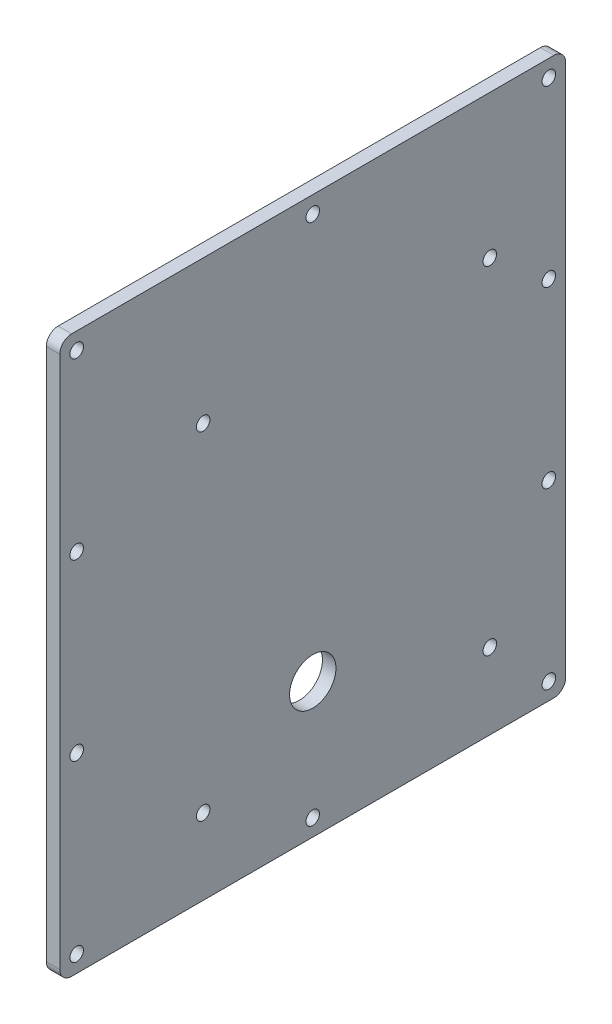
ISO-10303-21;
HEADER;
FILE_DESCRIPTION(('STEP AP214'),'2;1');
FILE_NAME('part.step','',(''),(''),'','','');
FILE_SCHEMA(('AUTOMOTIVE_DESIGN { 1 0 10303 214 1 1 1 1 }'));
ENDSEC;
DATA;
#1=APPLICATION_CONTEXT('core data for automotive mechanical design processes');
#2=APPLICATION_PROTOCOL_DEFINITION('international standard','automotive_design',2000,#1);
#3=PRODUCT_CONTEXT('',#1,'mechanical');
#4=PRODUCT('Part','Part','',(#3));
#5=PRODUCT_RELATED_PRODUCT_CATEGORY('part','',(#4));
#6=PRODUCT_DEFINITION_FORMATION('','',#4);
#7=PRODUCT_DEFINITION_CONTEXT('part definition',#1,'design');
#8=PRODUCT_DEFINITION('design','',#6,#7);
#9=PRODUCT_DEFINITION_SHAPE('','',#8);
#10=(LENGTH_UNIT() NAMED_UNIT(*) SI_UNIT(.MILLI.,.METRE.));
#11=(NAMED_UNIT(*) PLANE_ANGLE_UNIT() SI_UNIT($,.RADIAN.));
#12=(NAMED_UNIT(*) SI_UNIT($,.STERADIAN.) SOLID_ANGLE_UNIT());
#13=UNCERTAINTY_MEASURE_WITH_UNIT(LENGTH_MEASURE(1.E-05),#10,'distance_accuracy_value','');
#14=(GEOMETRIC_REPRESENTATION_CONTEXT(3) GLOBAL_UNCERTAINTY_ASSIGNED_CONTEXT((#13)) GLOBAL_UNIT_ASSIGNED_CONTEXT((#10,
#11,#12)) REPRESENTATION_CONTEXT('',''));
#15=CARTESIAN_POINT('',(0.,0.,0.));
#16=DIRECTION('',(0.,0.,1.));
#17=DIRECTION('',(1.,0.,0.));
#18=AXIS2_PLACEMENT_3D('',#15,#16,#17);
#19=CARTESIAN_POINT('',(0.,0.,0.));
#20=DIRECTION('',(-1.,0.,0.));
#21=DIRECTION('',(0.,0.,1.));
#22=AXIS2_PLACEMENT_3D('',#19,#20,#21);
#23=PLANE('',#22);
#24=DIRECTION('',(0.,0.,-1.));
#25=VECTOR('',#24,1.);
#26=CARTESIAN_POINT('',(0.,0.,0.));
#27=LINE('',#26,#25);
#28=CARTESIAN_POINT('',(0.,0.,-4.445));
#29=VERTEX_POINT('',#28);
#30=CARTESIAN_POINT('',(0.,0.,-186.055));
#31=VERTEX_POINT('',#30);
#32=EDGE_CURVE('E133',#29,#31,#27,.T.);
#33=ORIENTED_EDGE('',*,*,#32,.F.);
#34=CARTESIAN_POINT('',(0.,4.445,-4.445));
#35=DIRECTION('',(-1.,0.,0.));
#36=DIRECTION('',(0.,0.,1.));
#37=AXIS2_PLACEMENT_3D('',#34,#35,#36);
#38=CIRCLE('',#37,4.445);
#39=CARTESIAN_POINT('',(0.,4.445,0.));
#40=VERTEX_POINT('',#39);
#41=EDGE_CURVE('E116',#29,#40,#38,.T.);
#42=ORIENTED_EDGE('',*,*,#41,.T.);
#43=DIRECTION('',(0.,-1.,0.));
#44=VECTOR('',#43,1.);
#45=CARTESIAN_POINT('',(0.,0.,0.));
#46=LINE('',#45,#44);
#47=CARTESIAN_POINT('',(0.,205.105,0.));
#48=VERTEX_POINT('',#47);
#49=EDGE_CURVE('E143',#48,#40,#46,.T.);
#50=ORIENTED_EDGE('',*,*,#49,.F.);
#51=CARTESIAN_POINT('',(0.,205.105,-4.445));
#52=DIRECTION('',(-1.,0.,0.));
#53=DIRECTION('',(0.,0.,1.));
#54=AXIS2_PLACEMENT_3D('',#51,#52,#53);
#55=CIRCLE('',#54,4.445);
#56=CARTESIAN_POINT('',(0.,209.55,-4.445));
#57=VERTEX_POINT('',#56);
#58=EDGE_CURVE('E137',#48,#57,#55,.T.);
#59=ORIENTED_EDGE('',*,*,#58,.T.);
#60=DIRECTION('',(0.,0.,1.));
#61=VECTOR('',#60,1.);
#62=CARTESIAN_POINT('',(0.,209.55,0.));
#63=LINE('',#62,#61);
#64=CARTESIAN_POINT('',(0.,209.55,-186.055));
#65=VERTEX_POINT('',#64);
#66=EDGE_CURVE('E146',#65,#57,#63,.T.);
#67=ORIENTED_EDGE('',*,*,#66,.F.);
#68=CARTESIAN_POINT('',(0.,205.105,-186.055));
#69=DIRECTION('',(-1.,0.,0.));
#70=DIRECTION('',(0.,0.,1.));
#71=AXIS2_PLACEMENT_3D('',#68,#69,#70);
#72=CIRCLE('',#71,4.445);
#73=CARTESIAN_POINT('',(0.,205.105,-190.5));
#74=VERTEX_POINT('',#73);
#75=EDGE_CURVE('E157',#65,#74,#72,.T.);
#76=ORIENTED_EDGE('',*,*,#75,.T.);
#77=DIRECTION('',(0.,1.,0.));
#78=VECTOR('',#77,1.);
#79=CARTESIAN_POINT('',(0.,0.,-190.5));
#80=LINE('',#79,#78);
#81=CARTESIAN_POINT('',(0.,4.445,-190.5));
#82=VERTEX_POINT('',#81);
#83=EDGE_CURVE('E142',#82,#74,#80,.T.);
#84=ORIENTED_EDGE('',*,*,#83,.F.);
#85=CARTESIAN_POINT('',(0.,4.445,-186.055));
#86=DIRECTION('',(-1.,0.,0.));
#87=DIRECTION('',(0.,0.,1.));
#88=AXIS2_PLACEMENT_3D('',#85,#86,#87);
#89=CIRCLE('',#88,4.445);
#90=EDGE_CURVE('E127',#82,#31,#89,.T.);
#91=ORIENTED_EDGE('',*,*,#90,.T.);
#92=EDGE_LOOP('',(#33,#42,#50,#59,#67,#76,#84,#91));
#93=FACE_BOUND('',#92,.T.);
#94=CARTESIAN_POINT('',(0.,50.8000000000041,-95.25));
#95=DIRECTION('',(1.,0.,0.));
#96=DIRECTION('',(0.,0.,-1.));
#97=AXIS2_PLACEMENT_3D('',#94,#95,#96);
#98=CIRCLE('',#97,8.73125);
#99=CARTESIAN_POINT('',(0.,50.8000000000041,-103.98125));
#100=VERTEX_POINT('',#99);
#101=EDGE_CURVE('E148',#100,#100,#98,.T.);
#102=ORIENTED_EDGE('',*,*,#101,.T.);
#103=EDGE_LOOP('',(#102));
#104=FACE_BOUND('',#103,.T.);
#105=CARTESIAN_POINT('',(0.,28.5749999999997,-53.9750000000013));
#106=DIRECTION('',(1.,0.,0.));
#107=DIRECTION('',(0.,0.,-1.));
#108=AXIS2_PLACEMENT_3D('',#105,#106,#107);
#109=CIRCLE('',#108,2.5527);
#110=CARTESIAN_POINT('',(0.,28.5749999999997,-56.5277000000013));
#111=VERTEX_POINT('',#110);
#112=EDGE_CURVE('E196',#111,#111,#109,.T.);
#113=ORIENTED_EDGE('',*,*,#112,.T.);
#114=EDGE_LOOP('',(#113));
#115=FACE_BOUND('',#114,.T.);
#116=CARTESIAN_POINT('',(0.,28.5750000000009,-161.925));
#117=DIRECTION('',(1.,0.,0.));
#118=DIRECTION('',(0.,0.,-1.));
#119=AXIS2_PLACEMENT_3D('',#116,#117,#118);
#120=CIRCLE('',#119,2.5527);
#121=CARTESIAN_POINT('',(0.,28.5750000000009,-164.4777));
#122=VERTEX_POINT('',#121);
#123=EDGE_CURVE('E204',#122,#122,#120,.T.);
#124=ORIENTED_EDGE('',*,*,#123,.T.);
#125=EDGE_LOOP('',(#124));
#126=FACE_BOUND('',#125,.T.);
#127=CARTESIAN_POINT('',(0.,155.575000000001,-161.925));
#128=DIRECTION('',(1.,0.,0.));
#129=DIRECTION('',(0.,0.,-1.));
#130=AXIS2_PLACEMENT_3D('',#127,#128,#129);
#131=CIRCLE('',#130,2.55269999999999);
#132=CARTESIAN_POINT('',(0.,155.575000000001,-164.4777));
#133=VERTEX_POINT('',#132);
#134=EDGE_CURVE('E210',#133,#133,#131,.T.);
#135=ORIENTED_EDGE('',*,*,#134,.T.);
#136=EDGE_LOOP('',(#135));
#137=FACE_BOUND('',#136,.T.);
#138=CARTESIAN_POINT('',(0.,155.575000000001,-53.9750000000003));
#139=DIRECTION('',(1.,0.,0.));
#140=DIRECTION('',(0.,0.,-1.));
#141=AXIS2_PLACEMENT_3D('',#138,#139,#140);
#142=CIRCLE('',#141,2.55269999999999);
#143=CARTESIAN_POINT('',(0.,155.575000000001,-56.5277000000003));
#144=VERTEX_POINT('',#143);
#145=EDGE_CURVE('E216',#144,#144,#142,.T.);
#146=ORIENTED_EDGE('',*,*,#145,.T.);
#147=EDGE_LOOP('',(#146));
#148=FACE_BOUND('',#147,.T.);
#149=CARTESIAN_POINT('',(0.,137.583333333333,-184.15));
#150=DIRECTION('',(1.,0.,0.));
#151=DIRECTION('',(0.,0.,-1.));
#152=AXIS2_PLACEMENT_3D('',#149,#150,#151);
#153=CIRCLE('',#152,2.55269999999999);
#154=CARTESIAN_POINT('',(0.,137.583333333333,-186.7027));
#155=VERTEX_POINT('',#154);
#156=EDGE_CURVE('E222',#155,#155,#153,.T.);
#157=ORIENTED_EDGE('',*,*,#156,.T.);
#158=EDGE_LOOP('',(#157));
#159=FACE_BOUND('',#158,.T.);
#160=CARTESIAN_POINT('',(0.,71.9666666666667,-184.15));
#161=DIRECTION('',(1.,0.,0.));
#162=DIRECTION('',(0.,0.,-1.));
#163=AXIS2_PLACEMENT_3D('',#160,#161,#162);
#164=CIRCLE('',#163,2.55270000000001);
#165=CARTESIAN_POINT('',(0.,71.9666666666667,-186.7027));
#166=VERTEX_POINT('',#165);
#167=EDGE_CURVE('E228',#166,#166,#164,.T.);
#168=ORIENTED_EDGE('',*,*,#167,.T.);
#169=EDGE_LOOP('',(#168));
#170=FACE_BOUND('',#169,.T.);
#171=CARTESIAN_POINT('',(0.,71.9666666666667,-6.35000000000002));
#172=DIRECTION('',(1.,0.,0.));
#173=DIRECTION('',(0.,0.,-1.));
#174=AXIS2_PLACEMENT_3D('',#171,#172,#173);
#175=CIRCLE('',#174,2.55270000000001);
#176=CARTESIAN_POINT('',(0.,71.9666666666667,-8.90270000000002));
#177=VERTEX_POINT('',#176);
#178=EDGE_CURVE('E234',#177,#177,#175,.T.);
#179=ORIENTED_EDGE('',*,*,#178,.T.);
#180=EDGE_LOOP('',(#179));
#181=FACE_BOUND('',#180,.T.);
#182=CARTESIAN_POINT('',(0.,137.583333333333,-6.35000000000001));
#183=DIRECTION('',(1.,0.,0.));
#184=DIRECTION('',(0.,0.,-1.));
#185=AXIS2_PLACEMENT_3D('',#182,#183,#184);
#186=CIRCLE('',#185,2.55269999999999);
#187=CARTESIAN_POINT('',(0.,137.583333333333,-8.9027));
#188=VERTEX_POINT('',#187);
#189=EDGE_CURVE('E240',#188,#188,#186,.T.);
#190=ORIENTED_EDGE('',*,*,#189,.T.);
#191=EDGE_LOOP('',(#190));
#192=FACE_BOUND('',#191,.T.);
#193=CARTESIAN_POINT('',(0.,203.2,-95.25));
#194=DIRECTION('',(1.,0.,0.));
#195=DIRECTION('',(0.,0.,-1.));
#196=AXIS2_PLACEMENT_3D('',#193,#194,#195);
#197=CIRCLE('',#196,2.55269999999999);
#198=CARTESIAN_POINT('',(0.,203.2,-97.8027));
#199=VERTEX_POINT('',#198);
#200=EDGE_CURVE('E246',#199,#199,#197,.T.);
#201=ORIENTED_EDGE('',*,*,#200,.T.);
#202=EDGE_LOOP('',(#201));
#203=FACE_BOUND('',#202,.T.);
#204=CARTESIAN_POINT('',(0.,6.35,-95.25));
#205=DIRECTION('',(1.,0.,0.));
#206=DIRECTION('',(0.,0.,-1.));
#207=AXIS2_PLACEMENT_3D('',#204,#205,#206);
#208=CIRCLE('',#207,2.5527);
#209=CARTESIAN_POINT('',(0.,6.35,-97.8027));
#210=VERTEX_POINT('',#209);
#211=EDGE_CURVE('E252',#210,#210,#208,.T.);
#212=ORIENTED_EDGE('',*,*,#211,.T.);
#213=EDGE_LOOP('',(#212));
#214=FACE_BOUND('',#213,.T.);
#215=CARTESIAN_POINT('',(0.,203.2,-184.15));
#216=DIRECTION('',(1.,0.,0.));
#217=DIRECTION('',(0.,0.,-1.));
#218=AXIS2_PLACEMENT_3D('',#215,#216,#217);
#219=CIRCLE('',#218,2.55269999999999);
#220=CARTESIAN_POINT('',(0.,203.2,-186.7027));
#221=VERTEX_POINT('',#220);
#222=EDGE_CURVE('E258',#221,#221,#219,.T.);
#223=ORIENTED_EDGE('',*,*,#222,.T.);
#224=EDGE_LOOP('',(#223));
#225=FACE_BOUND('',#224,.T.);
#226=CARTESIAN_POINT('',(0.,6.35,-6.35000000000003));
#227=DIRECTION('',(1.,0.,0.));
#228=DIRECTION('',(0.,0.,-1.));
#229=AXIS2_PLACEMENT_3D('',#226,#227,#228);
#230=CIRCLE('',#229,2.5527);
#231=CARTESIAN_POINT('',(0.,6.35,-8.90270000000003));
#232=VERTEX_POINT('',#231);
#233=EDGE_CURVE('E264',#232,#232,#230,.T.);
#234=ORIENTED_EDGE('',*,*,#233,.T.);
#235=EDGE_LOOP('',(#234));
#236=FACE_BOUND('',#235,.T.);
#237=CARTESIAN_POINT('',(0.,6.35000000000003,-184.15));
#238=DIRECTION('',(1.,0.,0.));
#239=DIRECTION('',(0.,0.,-1.));
#240=AXIS2_PLACEMENT_3D('',#237,#238,#239);
#241=CIRCLE('',#240,2.5527);
#242=CARTESIAN_POINT('',(0.,6.35000000000003,-186.7027));
#243=VERTEX_POINT('',#242);
#244=EDGE_CURVE('E270',#243,#243,#241,.T.);
#245=ORIENTED_EDGE('',*,*,#244,.T.);
#246=EDGE_LOOP('',(#245));
#247=FACE_BOUND('',#246,.T.);
#248=CARTESIAN_POINT('',(0.,203.2,-6.35));
#249=DIRECTION('',(1.,0.,0.));
#250=DIRECTION('',(0.,0.,-1.));
#251=AXIS2_PLACEMENT_3D('',#248,#249,#250);
#252=CIRCLE('',#251,2.55269999999999);
#253=CARTESIAN_POINT('',(0.,203.2,-8.90269999999999));
#254=VERTEX_POINT('',#253);
#255=EDGE_CURVE('E276',#254,#254,#252,.T.);
#256=ORIENTED_EDGE('',*,*,#255,.T.);
#257=EDGE_LOOP('',(#256));
#258=FACE_BOUND('',#257,.T.);
#259=ADVANCED_FACE('F50',(#93,#104,#115,#126,#137,#148,#159,#170,#181,#192,#203,#214,#225,#236,
#247,#258),#23,.T.);
#260=CARTESIAN_POINT('',(5.08,0.,0.));
#261=DIRECTION('',(0.,0.,-1.));
#262=DIRECTION('',(-1.,0.,0.));
#263=AXIS2_PLACEMENT_3D('',#260,#261,#262);
#264=PLANE('',#263);
#265=ORIENTED_EDGE('',*,*,#49,.T.);
#266=DIRECTION('',(-1.,0.,0.));
#267=VECTOR('',#266,1.);
#268=CARTESIAN_POINT('',(5.08,4.445,0.));
#269=LINE('',#268,#267);
#270=CARTESIAN_POINT('',(5.08,4.445,0.));
#271=VERTEX_POINT('',#270);
#272=EDGE_CURVE('E121',#40,#271,#269,.F.);
#273=ORIENTED_EDGE('',*,*,#272,.T.);
#274=DIRECTION('',(0.,-1.,0.));
#275=VECTOR('',#274,1.);
#276=CARTESIAN_POINT('',(5.08,0.,0.));
#277=LINE('',#276,#275);
#278=CARTESIAN_POINT('',(5.08,205.105,0.));
#279=VERTEX_POINT('',#278);
#280=EDGE_CURVE('E153',#279,#271,#277,.T.);
#281=ORIENTED_EDGE('',*,*,#280,.F.);
#282=DIRECTION('',(-1.,0.,0.));
#283=VECTOR('',#282,1.);
#284=CARTESIAN_POINT('',(5.08,205.105,0.));
#285=LINE('',#284,#283);
#286=EDGE_CURVE('E126',#279,#48,#285,.T.);
#287=ORIENTED_EDGE('',*,*,#286,.T.);
#288=EDGE_LOOP('',(#265,#273,#281,#287));
#289=FACE_BOUND('',#288,.T.);
#290=ADVANCED_FACE('F320',(#289),#264,.F.);
#291=CARTESIAN_POINT('',(5.08,0.,0.));
#292=DIRECTION('',(0.,1.,0.));
#293=DIRECTION('',(0.,0.,1.));
#294=AXIS2_PLACEMENT_3D('',#291,#292,#293);
#295=PLANE('',#294);
#296=DIRECTION('',(0.,0.,-1.));
#297=VECTOR('',#296,1.);
#298=CARTESIAN_POINT('',(5.08,0.,0.));
#299=LINE('',#298,#297);
#300=CARTESIAN_POINT('',(5.08,0.,-4.445));
#301=VERTEX_POINT('',#300);
#302=CARTESIAN_POINT('',(5.08,0.,-186.055));
#303=VERTEX_POINT('',#302);
#304=EDGE_CURVE('E136',#301,#303,#299,.T.);
#305=ORIENTED_EDGE('',*,*,#304,.F.);
#306=DIRECTION('',(-1.,0.,0.));
#307=VECTOR('',#306,1.);
#308=CARTESIAN_POINT('',(5.08,0.,-4.445));
#309=LINE('',#308,#307);
#310=EDGE_CURVE('E120',#301,#29,#309,.T.);
#311=ORIENTED_EDGE('',*,*,#310,.T.);
#312=ORIENTED_EDGE('',*,*,#32,.T.);
#313=DIRECTION('',(-1.,0.,0.));
#314=VECTOR('',#313,1.);
#315=CARTESIAN_POINT('',(5.08,0.,-186.055));
#316=LINE('',#315,#314);
#317=EDGE_CURVE('E138',#31,#303,#316,.F.);
#318=ORIENTED_EDGE('',*,*,#317,.T.);
#319=EDGE_LOOP('',(#305,#311,#312,#318));
#320=FACE_BOUND('',#319,.T.);
#321=ADVANCED_FACE('F132',(#320),#295,.F.);
#322=CARTESIAN_POINT('',(5.08,0.,-190.5));
#323=DIRECTION('',(0.,0.,1.));
#324=DIRECTION('',(1.,0.,0.));
#325=AXIS2_PLACEMENT_3D('',#322,#323,#324);
#326=PLANE('',#325);
#327=DIRECTION('',(0.,1.,0.));
#328=VECTOR('',#327,1.);
#329=CARTESIAN_POINT('',(5.08,0.,-190.5));
#330=LINE('',#329,#328);
#331=CARTESIAN_POINT('',(5.08,4.445,-190.5));
#332=VERTEX_POINT('',#331);
#333=CARTESIAN_POINT('',(5.08,205.105,-190.5));
#334=VERTEX_POINT('',#333);
#335=EDGE_CURVE('E179',#332,#334,#330,.T.);
#336=ORIENTED_EDGE('',*,*,#335,.F.);
#337=DIRECTION('',(-1.,0.,0.));
#338=VECTOR('',#337,1.);
#339=CARTESIAN_POINT('',(5.08,4.445,-190.5));
#340=LINE('',#339,#338);
#341=EDGE_CURVE('E172',#332,#82,#340,.T.);
#342=ORIENTED_EDGE('',*,*,#341,.T.);
#343=ORIENTED_EDGE('',*,*,#83,.T.);
#344=DIRECTION('',(-1.,0.,0.));
#345=VECTOR('',#344,1.);
#346=CARTESIAN_POINT('',(5.08,205.105,-190.5));
#347=LINE('',#346,#345);
#348=EDGE_CURVE('E170',#74,#334,#347,.F.);
#349=ORIENTED_EDGE('',*,*,#348,.T.);
#350=EDGE_LOOP('',(#336,#342,#343,#349));
#351=FACE_BOUND('',#350,.T.);
#352=ADVANCED_FACE('F177',(#351),#326,.F.);
#353=CARTESIAN_POINT('',(5.08,209.55,0.));
#354=DIRECTION('',(0.,-1.,0.));
#355=DIRECTION('',(0.,0.,-1.));
#356=AXIS2_PLACEMENT_3D('',#353,#354,#355);
#357=PLANE('',#356);
#358=DIRECTION('',(0.,0.,1.));
#359=VECTOR('',#358,1.);
#360=CARTESIAN_POINT('',(5.08,209.55,0.));
#361=LINE('',#360,#359);
#362=CARTESIAN_POINT('',(5.08,209.55,-186.055));
#363=VERTEX_POINT('',#362);
#364=CARTESIAN_POINT('',(5.08,209.55,-4.445));
#365=VERTEX_POINT('',#364);
#366=EDGE_CURVE('E154',#363,#365,#361,.T.);
#367=ORIENTED_EDGE('',*,*,#366,.F.);
#368=DIRECTION('',(-1.,0.,0.));
#369=VECTOR('',#368,1.);
#370=CARTESIAN_POINT('',(5.08,209.55,-186.055));
#371=LINE('',#370,#369);
#372=EDGE_CURVE('E13',#363,#65,#371,.T.);
#373=ORIENTED_EDGE('',*,*,#372,.T.);
#374=ORIENTED_EDGE('',*,*,#66,.T.);
#375=DIRECTION('',(-1.,0.,0.));
#376=VECTOR('',#375,1.);
#377=CARTESIAN_POINT('',(5.08,209.55,-4.445));
#378=LINE('',#377,#376);
#379=EDGE_CURVE('E58',#57,#365,#378,.F.);
#380=ORIENTED_EDGE('',*,*,#379,.T.);
#381=EDGE_LOOP('',(#367,#373,#374,#380));
#382=FACE_BOUND('',#381,.T.);
#383=ADVANCED_FACE('F186',(#382),#357,.F.);
#384=CARTESIAN_POINT('',(5.08,0.,0.));
#385=DIRECTION('',(-1.,0.,0.));
#386=DIRECTION('',(0.,0.,1.));
#387=AXIS2_PLACEMENT_3D('',#384,#385,#386);
#388=PLANE('',#387);
#389=CARTESIAN_POINT('',(5.08,203.2,-6.35));
#390=DIRECTION('',(1.,0.,0.));
#391=DIRECTION('',(0.,0.,-1.));
#392=AXIS2_PLACEMENT_3D('',#389,#390,#391);
#393=CIRCLE('',#392,2.55269999999999);
#394=CARTESIAN_POINT('',(5.08,203.2,-8.90269999999999));
#395=VERTEX_POINT('',#394);
#396=EDGE_CURVE('E279',#395,#395,#393,.T.);
#397=ORIENTED_EDGE('',*,*,#396,.F.);
#398=EDGE_LOOP('',(#397));
#399=FACE_BOUND('',#398,.T.);
#400=CARTESIAN_POINT('',(5.08,6.35000000000003,-184.15));
#401=DIRECTION('',(1.,0.,0.));
#402=DIRECTION('',(0.,0.,-1.));
#403=AXIS2_PLACEMENT_3D('',#400,#401,#402);
#404=CIRCLE('',#403,2.5527);
#405=CARTESIAN_POINT('',(5.08,6.35000000000003,-186.7027));
#406=VERTEX_POINT('',#405);
#407=EDGE_CURVE('E273',#406,#406,#404,.T.);
#408=ORIENTED_EDGE('',*,*,#407,.F.);
#409=EDGE_LOOP('',(#408));
#410=FACE_BOUND('',#409,.T.);
#411=CARTESIAN_POINT('',(5.08,6.35,-6.35000000000003));
#412=DIRECTION('',(1.,0.,0.));
#413=DIRECTION('',(0.,0.,-1.));
#414=AXIS2_PLACEMENT_3D('',#411,#412,#413);
#415=CIRCLE('',#414,2.5527);
#416=CARTESIAN_POINT('',(5.08,6.35,-8.90270000000003));
#417=VERTEX_POINT('',#416);
#418=EDGE_CURVE('E267',#417,#417,#415,.T.);
#419=ORIENTED_EDGE('',*,*,#418,.F.);
#420=EDGE_LOOP('',(#419));
#421=FACE_BOUND('',#420,.T.);
#422=CARTESIAN_POINT('',(5.08,203.2,-184.15));
#423=DIRECTION('',(1.,0.,0.));
#424=DIRECTION('',(0.,0.,-1.));
#425=AXIS2_PLACEMENT_3D('',#422,#423,#424);
#426=CIRCLE('',#425,2.55269999999999);
#427=CARTESIAN_POINT('',(5.08,203.2,-186.7027));
#428=VERTEX_POINT('',#427);
#429=EDGE_CURVE('E261',#428,#428,#426,.T.);
#430=ORIENTED_EDGE('',*,*,#429,.F.);
#431=EDGE_LOOP('',(#430));
#432=FACE_BOUND('',#431,.T.);
#433=CARTESIAN_POINT('',(5.08,6.35,-95.25));
#434=DIRECTION('',(1.,0.,0.));
#435=DIRECTION('',(0.,0.,-1.));
#436=AXIS2_PLACEMENT_3D('',#433,#434,#435);
#437=CIRCLE('',#436,2.5527);
#438=CARTESIAN_POINT('',(5.08,6.35,-97.8027));
#439=VERTEX_POINT('',#438);
#440=EDGE_CURVE('E255',#439,#439,#437,.T.);
#441=ORIENTED_EDGE('',*,*,#440,.F.);
#442=EDGE_LOOP('',(#441));
#443=FACE_BOUND('',#442,.T.);
#444=CARTESIAN_POINT('',(5.08,203.2,-95.25));
#445=DIRECTION('',(1.,0.,0.));
#446=DIRECTION('',(0.,0.,-1.));
#447=AXIS2_PLACEMENT_3D('',#444,#445,#446);
#448=CIRCLE('',#447,2.55269999999999);
#449=CARTESIAN_POINT('',(5.08,203.2,-97.8027));
#450=VERTEX_POINT('',#449);
#451=EDGE_CURVE('E249',#450,#450,#448,.T.);
#452=ORIENTED_EDGE('',*,*,#451,.F.);
#453=EDGE_LOOP('',(#452));
#454=FACE_BOUND('',#453,.T.);
#455=CARTESIAN_POINT('',(5.08,137.583333333333,-6.35000000000001));
#456=DIRECTION('',(1.,0.,0.));
#457=DIRECTION('',(0.,0.,-1.));
#458=AXIS2_PLACEMENT_3D('',#455,#456,#457);
#459=CIRCLE('',#458,2.55269999999999);
#460=CARTESIAN_POINT('',(5.08,137.583333333333,-8.9027));
#461=VERTEX_POINT('',#460);
#462=EDGE_CURVE('E243',#461,#461,#459,.T.);
#463=ORIENTED_EDGE('',*,*,#462,.F.);
#464=EDGE_LOOP('',(#463));
#465=FACE_BOUND('',#464,.T.);
#466=CARTESIAN_POINT('',(5.08,71.9666666666667,-6.35000000000002));
#467=DIRECTION('',(1.,0.,0.));
#468=DIRECTION('',(0.,0.,-1.));
#469=AXIS2_PLACEMENT_3D('',#466,#467,#468);
#470=CIRCLE('',#469,2.55270000000001);
#471=CARTESIAN_POINT('',(5.08,71.9666666666667,-8.90270000000002));
#472=VERTEX_POINT('',#471);
#473=EDGE_CURVE('E237',#472,#472,#470,.T.);
#474=ORIENTED_EDGE('',*,*,#473,.F.);
#475=EDGE_LOOP('',(#474));
#476=FACE_BOUND('',#475,.T.);
#477=CARTESIAN_POINT('',(5.08,71.9666666666667,-184.15));
#478=DIRECTION('',(1.,0.,0.));
#479=DIRECTION('',(0.,0.,-1.));
#480=AXIS2_PLACEMENT_3D('',#477,#478,#479);
#481=CIRCLE('',#480,2.55270000000001);
#482=CARTESIAN_POINT('',(5.08,71.9666666666667,-186.7027));
#483=VERTEX_POINT('',#482);
#484=EDGE_CURVE('E231',#483,#483,#481,.T.);
#485=ORIENTED_EDGE('',*,*,#484,.F.);
#486=EDGE_LOOP('',(#485));
#487=FACE_BOUND('',#486,.T.);
#488=CARTESIAN_POINT('',(5.08,137.583333333333,-184.15));
#489=DIRECTION('',(1.,0.,0.));
#490=DIRECTION('',(0.,0.,-1.));
#491=AXIS2_PLACEMENT_3D('',#488,#489,#490);
#492=CIRCLE('',#491,2.55269999999999);
#493=CARTESIAN_POINT('',(5.08,137.583333333333,-186.7027));
#494=VERTEX_POINT('',#493);
#495=EDGE_CURVE('E225',#494,#494,#492,.T.);
#496=ORIENTED_EDGE('',*,*,#495,.F.);
#497=EDGE_LOOP('',(#496));
#498=FACE_BOUND('',#497,.T.);
#499=CARTESIAN_POINT('',(5.08,155.575000000001,-53.9750000000003));
#500=DIRECTION('',(1.,0.,0.));
#501=DIRECTION('',(0.,0.,-1.));
#502=AXIS2_PLACEMENT_3D('',#499,#500,#501);
#503=CIRCLE('',#502,2.55269999999999);
#504=CARTESIAN_POINT('',(5.08,155.575000000001,-56.5277000000003));
#505=VERTEX_POINT('',#504);
#506=EDGE_CURVE('E219',#505,#505,#503,.T.);
#507=ORIENTED_EDGE('',*,*,#506,.F.);
#508=EDGE_LOOP('',(#507));
#509=FACE_BOUND('',#508,.T.);
#510=CARTESIAN_POINT('',(5.08,155.575000000001,-161.925));
#511=DIRECTION('',(1.,0.,0.));
#512=DIRECTION('',(0.,0.,-1.));
#513=AXIS2_PLACEMENT_3D('',#510,#511,#512);
#514=CIRCLE('',#513,2.55269999999999);
#515=CARTESIAN_POINT('',(5.08,155.575000000001,-164.4777));
#516=VERTEX_POINT('',#515);
#517=EDGE_CURVE('E213',#516,#516,#514,.T.);
#518=ORIENTED_EDGE('',*,*,#517,.F.);
#519=EDGE_LOOP('',(#518));
#520=FACE_BOUND('',#519,.T.);
#521=CARTESIAN_POINT('',(5.08,28.5750000000009,-161.925));
#522=DIRECTION('',(1.,0.,0.));
#523=DIRECTION('',(0.,0.,-1.));
#524=AXIS2_PLACEMENT_3D('',#521,#522,#523);
#525=CIRCLE('',#524,2.5527);
#526=CARTESIAN_POINT('',(5.08,28.5750000000009,-164.4777));
#527=VERTEX_POINT('',#526);
#528=EDGE_CURVE('E207',#527,#527,#525,.T.);
#529=ORIENTED_EDGE('',*,*,#528,.F.);
#530=EDGE_LOOP('',(#529));
#531=FACE_BOUND('',#530,.T.);
#532=CARTESIAN_POINT('',(5.08,28.5749999999997,-53.9750000000013));
#533=DIRECTION('',(1.,0.,0.));
#534=DIRECTION('',(0.,0.,-1.));
#535=AXIS2_PLACEMENT_3D('',#532,#533,#534);
#536=CIRCLE('',#535,2.5527);
#537=CARTESIAN_POINT('',(5.08,28.5749999999997,-56.5277000000013));
#538=VERTEX_POINT('',#537);
#539=EDGE_CURVE('E201',#538,#538,#536,.T.);
#540=ORIENTED_EDGE('',*,*,#539,.F.);
#541=EDGE_LOOP('',(#540));
#542=FACE_BOUND('',#541,.T.);
#543=CARTESIAN_POINT('',(5.08,50.8000000000041,-95.25));
#544=DIRECTION('',(1.,0.,0.));
#545=DIRECTION('',(0.,0.,-1.));
#546=AXIS2_PLACEMENT_3D('',#543,#544,#545);
#547=CIRCLE('',#546,8.73125);
#548=CARTESIAN_POINT('',(5.08,50.8000000000041,-103.98125));
#549=VERTEX_POINT('',#548);
#550=EDGE_CURVE('E193',#549,#549,#547,.T.);
#551=ORIENTED_EDGE('',*,*,#550,.F.);
#552=EDGE_LOOP('',(#551));
#553=FACE_BOUND('',#552,.T.);
#554=ORIENTED_EDGE('',*,*,#280,.T.);
#555=CARTESIAN_POINT('',(5.08,4.445,-4.445));
#556=DIRECTION('',(-1.,0.,0.));
#557=DIRECTION('',(0.,0.,1.));
#558=AXIS2_PLACEMENT_3D('',#555,#556,#557);
#559=CIRCLE('',#558,4.445);
#560=EDGE_CURVE('E168',#271,#301,#559,.F.);
#561=ORIENTED_EDGE('',*,*,#560,.T.);
#562=ORIENTED_EDGE('',*,*,#304,.T.);
#563=CARTESIAN_POINT('',(5.08,4.445,-186.055));
#564=DIRECTION('',(-1.,0.,0.));
#565=DIRECTION('',(0.,0.,1.));
#566=AXIS2_PLACEMENT_3D('',#563,#564,#565);
#567=CIRCLE('',#566,4.445);
#568=EDGE_CURVE('E166',#303,#332,#567,.F.);
#569=ORIENTED_EDGE('',*,*,#568,.T.);
#570=ORIENTED_EDGE('',*,*,#335,.T.);
#571=CARTESIAN_POINT('',(5.08,205.105,-186.055));
#572=DIRECTION('',(-1.,0.,0.));
#573=DIRECTION('',(0.,0.,1.));
#574=AXIS2_PLACEMENT_3D('',#571,#572,#573);
#575=CIRCLE('',#574,4.445);
#576=EDGE_CURVE('E71',#334,#363,#575,.F.);
#577=ORIENTED_EDGE('',*,*,#576,.T.);
#578=ORIENTED_EDGE('',*,*,#366,.T.);
#579=CARTESIAN_POINT('',(5.08,205.105,-4.445));
#580=DIRECTION('',(-1.,0.,0.));
#581=DIRECTION('',(0.,0.,1.));
#582=AXIS2_PLACEMENT_3D('',#579,#580,#581);
#583=CIRCLE('',#582,4.445);
#584=EDGE_CURVE('E163',#365,#279,#583,.F.);
#585=ORIENTED_EDGE('',*,*,#584,.T.);
#586=EDGE_LOOP('',(#554,#561,#562,#569,#570,#577,#578,#585));
#587=FACE_BOUND('',#586,.T.);
#588=ADVANCED_FACE('F285',(#399,#410,#421,#432,#443,#454,#465,#476,#487,#498,#509,#520,#531,
#542,#553,#587),#388,.F.);
#589=CARTESIAN_POINT('',(0.,50.8000000000041,-95.25));
#590=DIRECTION('',(1.,0.,0.));
#591=DIRECTION('',(0.,0.,-1.));
#592=AXIS2_PLACEMENT_3D('',#589,#590,#591);
#593=CYLINDRICAL_SURFACE('',#592,8.73125);
#594=ORIENTED_EDGE('',*,*,#101,.F.);
#595=EDGE_LOOP('',(#594));
#596=FACE_BOUND('',#595,.T.);
#597=ORIENTED_EDGE('',*,*,#550,.T.);
#598=EDGE_LOOP('',(#597));
#599=FACE_BOUND('',#598,.T.);
#600=ADVANCED_FACE('F288',(#596,#599),#593,.F.);
#601=CARTESIAN_POINT('',(5.08,28.5749999999997,-53.9750000000013));
#602=DIRECTION('',(1.,0.,0.));
#603=DIRECTION('',(0.,0.,-1.));
#604=AXIS2_PLACEMENT_3D('',#601,#602,#603);
#605=CYLINDRICAL_SURFACE('',#604,2.5527);
#606=ORIENTED_EDGE('',*,*,#112,.F.);
#607=EDGE_LOOP('',(#606));
#608=FACE_BOUND('',#607,.T.);
#609=ORIENTED_EDGE('',*,*,#539,.T.);
#610=EDGE_LOOP('',(#609));
#611=FACE_BOUND('',#610,.T.);
#612=ADVANCED_FACE('F485',(#608,#611),#605,.F.);
#613=CARTESIAN_POINT('',(5.08,28.5750000000009,-161.925));
#614=DIRECTION('',(1.,0.,0.));
#615=DIRECTION('',(0.,0.,-1.));
#616=AXIS2_PLACEMENT_3D('',#613,#614,#615);
#617=CYLINDRICAL_SURFACE('',#616,2.5527);
#618=ORIENTED_EDGE('',*,*,#123,.F.);
#619=EDGE_LOOP('',(#618));
#620=FACE_BOUND('',#619,.T.);
#621=ORIENTED_EDGE('',*,*,#528,.T.);
#622=EDGE_LOOP('',(#621));
#623=FACE_BOUND('',#622,.T.);
#624=ADVANCED_FACE('F481',(#620,#623),#617,.F.);
#625=CARTESIAN_POINT('',(5.08,155.575000000001,-161.925));
#626=DIRECTION('',(1.,0.,0.));
#627=DIRECTION('',(0.,0.,-1.));
#628=AXIS2_PLACEMENT_3D('',#625,#626,#627);
#629=CYLINDRICAL_SURFACE('',#628,2.55269999999999);
#630=ORIENTED_EDGE('',*,*,#134,.F.);
#631=EDGE_LOOP('',(#630));
#632=FACE_BOUND('',#631,.T.);
#633=ORIENTED_EDGE('',*,*,#517,.T.);
#634=EDGE_LOOP('',(#633));
#635=FACE_BOUND('',#634,.T.);
#636=ADVANCED_FACE('F477',(#632,#635),#629,.F.);
#637=CARTESIAN_POINT('',(5.08,155.575000000001,-53.9750000000003));
#638=DIRECTION('',(1.,0.,0.));
#639=DIRECTION('',(0.,0.,-1.));
#640=AXIS2_PLACEMENT_3D('',#637,#638,#639);
#641=CYLINDRICAL_SURFACE('',#640,2.55269999999999);
#642=ORIENTED_EDGE('',*,*,#145,.F.);
#643=EDGE_LOOP('',(#642));
#644=FACE_BOUND('',#643,.T.);
#645=ORIENTED_EDGE('',*,*,#506,.T.);
#646=EDGE_LOOP('',(#645));
#647=FACE_BOUND('',#646,.T.);
#648=ADVANCED_FACE('F348',(#644,#647),#641,.F.);
#649=CARTESIAN_POINT('',(5.08,4.445,-4.445));
#650=DIRECTION('',(-1.,0.,0.));
#651=DIRECTION('',(0.,0.,1.));
#652=AXIS2_PLACEMENT_3D('',#649,#650,#651);
#653=CYLINDRICAL_SURFACE('',#652,4.445);
#654=ORIENTED_EDGE('',*,*,#560,.F.);
#655=ORIENTED_EDGE('',*,*,#272,.F.);
#656=ORIENTED_EDGE('',*,*,#41,.F.);
#657=ORIENTED_EDGE('',*,*,#310,.F.);
#658=EDGE_LOOP('',(#654,#655,#656,#657));
#659=FACE_BOUND('',#658,.T.);
#660=ADVANCED_FACE('F119',(#659),#653,.T.);
#661=CARTESIAN_POINT('',(5.08,4.445,-186.055));
#662=DIRECTION('',(-1.,0.,0.));
#663=DIRECTION('',(0.,0.,1.));
#664=AXIS2_PLACEMENT_3D('',#661,#662,#663);
#665=CYLINDRICAL_SURFACE('',#664,4.445);
#666=ORIENTED_EDGE('',*,*,#568,.F.);
#667=ORIENTED_EDGE('',*,*,#317,.F.);
#668=ORIENTED_EDGE('',*,*,#90,.F.);
#669=ORIENTED_EDGE('',*,*,#341,.F.);
#670=EDGE_LOOP('',(#666,#667,#668,#669));
#671=FACE_BOUND('',#670,.T.);
#672=ADVANCED_FACE('F331',(#671),#665,.T.);
#673=CARTESIAN_POINT('',(5.08,205.105,-186.055));
#674=DIRECTION('',(-1.,0.,0.));
#675=DIRECTION('',(0.,0.,1.));
#676=AXIS2_PLACEMENT_3D('',#673,#674,#675);
#677=CYLINDRICAL_SURFACE('',#676,4.445);
#678=ORIENTED_EDGE('',*,*,#576,.F.);
#679=ORIENTED_EDGE('',*,*,#348,.F.);
#680=ORIENTED_EDGE('',*,*,#75,.F.);
#681=ORIENTED_EDGE('',*,*,#372,.F.);
#682=EDGE_LOOP('',(#678,#679,#680,#681));
#683=FACE_BOUND('',#682,.T.);
#684=ADVANCED_FACE('F185',(#683),#677,.T.);
#685=CARTESIAN_POINT('',(5.08,205.105,-4.445));
#686=DIRECTION('',(-1.,0.,0.));
#687=DIRECTION('',(0.,0.,1.));
#688=AXIS2_PLACEMENT_3D('',#685,#686,#687);
#689=CYLINDRICAL_SURFACE('',#688,4.445);
#690=ORIENTED_EDGE('',*,*,#584,.F.);
#691=ORIENTED_EDGE('',*,*,#379,.F.);
#692=ORIENTED_EDGE('',*,*,#58,.F.);
#693=ORIENTED_EDGE('',*,*,#286,.F.);
#694=EDGE_LOOP('',(#690,#691,#692,#693));
#695=FACE_BOUND('',#694,.T.);
#696=ADVANCED_FACE('F52',(#695),#689,.T.);
#697=CARTESIAN_POINT('',(5.08,137.583333333333,-184.15));
#698=DIRECTION('',(1.,0.,0.));
#699=DIRECTION('',(0.,0.,-1.));
#700=AXIS2_PLACEMENT_3D('',#697,#698,#699);
#701=CYLINDRICAL_SURFACE('',#700,2.55269999999999);
#702=ORIENTED_EDGE('',*,*,#156,.F.);
#703=EDGE_LOOP('',(#702));
#704=FACE_BOUND('',#703,.T.);
#705=ORIENTED_EDGE('',*,*,#495,.T.);
#706=EDGE_LOOP('',(#705));
#707=FACE_BOUND('',#706,.T.);
#708=ADVANCED_FACE('F323',(#704,#707),#701,.F.);
#709=CARTESIAN_POINT('',(5.08,71.9666666666667,-184.15));
#710=DIRECTION('',(1.,0.,0.));
#711=DIRECTION('',(0.,0.,-1.));
#712=AXIS2_PLACEMENT_3D('',#709,#710,#711);
#713=CYLINDRICAL_SURFACE('',#712,2.55270000000001);
#714=ORIENTED_EDGE('',*,*,#167,.F.);
#715=EDGE_LOOP('',(#714));
#716=FACE_BOUND('',#715,.T.);
#717=ORIENTED_EDGE('',*,*,#484,.T.);
#718=EDGE_LOOP('',(#717));
#719=FACE_BOUND('',#718,.T.);
#720=ADVANCED_FACE('F328',(#716,#719),#713,.F.);
#721=CARTESIAN_POINT('',(5.08,71.9666666666667,-6.35000000000002));
#722=DIRECTION('',(1.,0.,0.));
#723=DIRECTION('',(0.,0.,-1.));
#724=AXIS2_PLACEMENT_3D('',#721,#722,#723);
#725=CYLINDRICAL_SURFACE('',#724,2.55270000000001);
#726=ORIENTED_EDGE('',*,*,#178,.F.);
#727=EDGE_LOOP('',(#726));
#728=FACE_BOUND('',#727,.T.);
#729=ORIENTED_EDGE('',*,*,#473,.T.);
#730=EDGE_LOOP('',(#729));
#731=FACE_BOUND('',#730,.T.);
#732=ADVANCED_FACE('F391',(#728,#731),#725,.F.);
#733=CARTESIAN_POINT('',(5.08,137.583333333333,-6.35000000000001));
#734=DIRECTION('',(1.,0.,0.));
#735=DIRECTION('',(0.,0.,-1.));
#736=AXIS2_PLACEMENT_3D('',#733,#734,#735);
#737=CYLINDRICAL_SURFACE('',#736,2.55269999999999);
#738=ORIENTED_EDGE('',*,*,#189,.F.);
#739=EDGE_LOOP('',(#738));
#740=FACE_BOUND('',#739,.T.);
#741=ORIENTED_EDGE('',*,*,#462,.T.);
#742=EDGE_LOOP('',(#741));
#743=FACE_BOUND('',#742,.T.);
#744=ADVANCED_FACE('F401',(#740,#743),#737,.F.);
#745=CARTESIAN_POINT('',(5.08,203.2,-95.25));
#746=DIRECTION('',(1.,0.,0.));
#747=DIRECTION('',(0.,0.,-1.));
#748=AXIS2_PLACEMENT_3D('',#745,#746,#747);
#749=CYLINDRICAL_SURFACE('',#748,2.55269999999999);
#750=ORIENTED_EDGE('',*,*,#200,.F.);
#751=EDGE_LOOP('',(#750));
#752=FACE_BOUND('',#751,.T.);
#753=ORIENTED_EDGE('',*,*,#451,.T.);
#754=EDGE_LOOP('',(#753));
#755=FACE_BOUND('',#754,.T.);
#756=ADVANCED_FACE('F411',(#752,#755),#749,.F.);
#757=CARTESIAN_POINT('',(5.08,6.35,-95.25));
#758=DIRECTION('',(1.,0.,0.));
#759=DIRECTION('',(0.,0.,-1.));
#760=AXIS2_PLACEMENT_3D('',#757,#758,#759);
#761=CYLINDRICAL_SURFACE('',#760,2.5527);
#762=ORIENTED_EDGE('',*,*,#211,.F.);
#763=EDGE_LOOP('',(#762));
#764=FACE_BOUND('',#763,.T.);
#765=ORIENTED_EDGE('',*,*,#440,.T.);
#766=EDGE_LOOP('',(#765));
#767=FACE_BOUND('',#766,.T.);
#768=ADVANCED_FACE('F421',(#764,#767),#761,.F.);
#769=CARTESIAN_POINT('',(5.08,203.2,-184.15));
#770=DIRECTION('',(1.,0.,0.));
#771=DIRECTION('',(0.,0.,-1.));
#772=AXIS2_PLACEMENT_3D('',#769,#770,#771);
#773=CYLINDRICAL_SURFACE('',#772,2.55269999999999);
#774=ORIENTED_EDGE('',*,*,#222,.F.);
#775=EDGE_LOOP('',(#774));
#776=FACE_BOUND('',#775,.T.);
#777=ORIENTED_EDGE('',*,*,#429,.T.);
#778=EDGE_LOOP('',(#777));
#779=FACE_BOUND('',#778,.T.);
#780=ADVANCED_FACE('F431',(#776,#779),#773,.F.);
#781=CARTESIAN_POINT('',(5.08,6.35,-6.35000000000003));
#782=DIRECTION('',(1.,0.,0.));
#783=DIRECTION('',(0.,0.,-1.));
#784=AXIS2_PLACEMENT_3D('',#781,#782,#783);
#785=CYLINDRICAL_SURFACE('',#784,2.5527);
#786=ORIENTED_EDGE('',*,*,#233,.F.);
#787=EDGE_LOOP('',(#786));
#788=FACE_BOUND('',#787,.T.);
#789=ORIENTED_EDGE('',*,*,#418,.T.);
#790=EDGE_LOOP('',(#789));
#791=FACE_BOUND('',#790,.T.);
#792=ADVANCED_FACE('F441',(#788,#791),#785,.F.);
#793=CARTESIAN_POINT('',(5.08,6.35000000000003,-184.15));
#794=DIRECTION('',(1.,0.,0.));
#795=DIRECTION('',(0.,0.,-1.));
#796=AXIS2_PLACEMENT_3D('',#793,#794,#795);
#797=CYLINDRICAL_SURFACE('',#796,2.5527);
#798=ORIENTED_EDGE('',*,*,#244,.F.);
#799=EDGE_LOOP('',(#798));
#800=FACE_BOUND('',#799,.T.);
#801=ORIENTED_EDGE('',*,*,#407,.T.);
#802=EDGE_LOOP('',(#801));
#803=FACE_BOUND('',#802,.T.);
#804=ADVANCED_FACE('F451',(#800,#803),#797,.F.);
#805=CARTESIAN_POINT('',(5.08,203.2,-6.35));
#806=DIRECTION('',(1.,0.,0.));
#807=DIRECTION('',(0.,0.,-1.));
#808=AXIS2_PLACEMENT_3D('',#805,#806,#807);
#809=CYLINDRICAL_SURFACE('',#808,2.55269999999999);
#810=ORIENTED_EDGE('',*,*,#255,.F.);
#811=EDGE_LOOP('',(#810));
#812=FACE_BOUND('',#811,.T.);
#813=ORIENTED_EDGE('',*,*,#396,.T.);
#814=EDGE_LOOP('',(#813));
#815=FACE_BOUND('',#814,.T.);
#816=ADVANCED_FACE('F283',(#812,#815),#809,.F.);
#817=CLOSED_SHELL('',(#259,#290,#321,#352,#383,#588,#600,#612,#624,#636,#648,#660,#672,#684,
#696,#708,#720,#732,#744,#756,#768,#780,#792,#804,#816));
#818=MANIFOLD_SOLID_BREP('B2',#817);
#819=ADVANCED_BREP_SHAPE_REPRESENTATION('',(#18,#818),#14);
#820=SHAPE_DEFINITION_REPRESENTATION(#9,#819);
ENDSEC;
END-ISO-10303-21;
